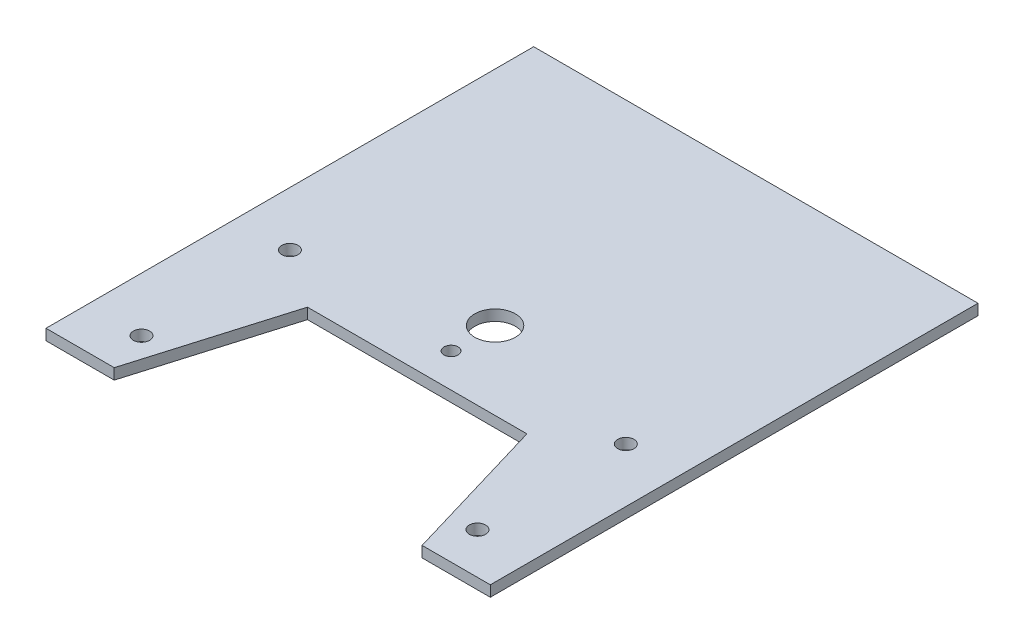
ISO-10303-21;
HEADER;
FILE_DESCRIPTION(('STEP AP214'),'2;1');
FILE_NAME('part.step','',(''),(''),'','','');
FILE_SCHEMA(('AUTOMOTIVE_DESIGN { 1 0 10303 214 1 1 1 1 }'));
ENDSEC;
DATA;
#1=APPLICATION_CONTEXT('core data for automotive mechanical design processes');
#2=APPLICATION_PROTOCOL_DEFINITION('international standard','automotive_design',2000,#1);
#3=PRODUCT_CONTEXT('',#1,'mechanical');
#4=PRODUCT('Part','Part','',(#3));
#5=PRODUCT_RELATED_PRODUCT_CATEGORY('part','',(#4));
#6=PRODUCT_DEFINITION_FORMATION('','',#4);
#7=PRODUCT_DEFINITION_CONTEXT('part definition',#1,'design');
#8=PRODUCT_DEFINITION('design','',#6,#7);
#9=PRODUCT_DEFINITION_SHAPE('','',#8);
#10=(LENGTH_UNIT() NAMED_UNIT(*) SI_UNIT(.MILLI.,.METRE.));
#11=(NAMED_UNIT(*) PLANE_ANGLE_UNIT() SI_UNIT($,.RADIAN.));
#12=(NAMED_UNIT(*) SI_UNIT($,.STERADIAN.) SOLID_ANGLE_UNIT());
#13=UNCERTAINTY_MEASURE_WITH_UNIT(LENGTH_MEASURE(1.E-05),#10,'distance_accuracy_value','');
#14=(GEOMETRIC_REPRESENTATION_CONTEXT(3) GLOBAL_UNCERTAINTY_ASSIGNED_CONTEXT((#13)) GLOBAL_UNIT_ASSIGNED_CONTEXT((#10,
#11,#12)) REPRESENTATION_CONTEXT('',''));
#15=CARTESIAN_POINT('',(0.,0.,0.));
#16=DIRECTION('',(0.,0.,1.));
#17=DIRECTION('',(1.,0.,0.));
#18=AXIS2_PLACEMENT_3D('',#15,#16,#17);
#19=CARTESIAN_POINT('',(0.,4.,0.));
#20=DIRECTION('',(0.,1.,0.));
#21=DIRECTION('',(0.,0.,1.));
#22=AXIS2_PLACEMENT_3D('',#19,#20,#21);
#23=PLANE('',#22);
#24=CARTESIAN_POINT('',(-62.,4.,19.99));
#25=DIRECTION('',(0.,-1.,0.));
#26=DIRECTION('',(0.,0.,-1.));
#27=AXIS2_PLACEMENT_3D('',#24,#25,#26);
#28=CIRCLE('',#27,3.);
#29=CARTESIAN_POINT('',(-62.,4.,16.99));
#30=VERTEX_POINT('',#29);
#31=EDGE_CURVE('E156',#30,#30,#28,.T.);
#32=ORIENTED_EDGE('',*,*,#31,.T.);
#33=EDGE_LOOP('',(#32));
#34=FACE_BOUND('',#33,.T.);
#35=CARTESIAN_POINT('',(-62.,4.,74.7499999999999));
#36=DIRECTION('',(0.,-1.,0.));
#37=DIRECTION('',(0.,0.,-1.));
#38=AXIS2_PLACEMENT_3D('',#35,#36,#37);
#39=CIRCLE('',#38,3.);
#40=CARTESIAN_POINT('',(-62.,4.,71.7499999999999));
#41=VERTEX_POINT('',#40);
#42=EDGE_CURVE('E148',#41,#41,#39,.T.);
#43=ORIENTED_EDGE('',*,*,#42,.T.);
#44=EDGE_LOOP('',(#43));
#45=FACE_BOUND('',#44,.T.);
#46=DIRECTION('',(-1.,0.,0.));
#47=VECTOR('',#46,1.);
#48=CARTESIAN_POINT('',(0.,4.,35.));
#49=LINE('',#48,#47);
#50=CARTESIAN_POINT('',(40.5,4.,35.));
#51=VERTEX_POINT('',#50);
#52=CARTESIAN_POINT('',(-40.5,4.,35.));
#53=VERTEX_POINT('',#52);
#54=EDGE_CURVE('E140',#51,#53,#49,.T.);
#55=ORIENTED_EDGE('',*,*,#54,.F.);
#56=DIRECTION('',(-0.284414731086838,0.,-0.958701340742153));
#57=VECTOR('',#56,1.);
#58=CARTESIAN_POINT('',(27.6804771193105,4.,-8.21187487872877));
#59=LINE('',#58,#57);
#60=CARTESIAN_POINT('',(56.8166666666666,4.,89.9999999999999));
#61=VERTEX_POINT('',#60);
#62=EDGE_CURVE('E134',#61,#51,#59,.T.);
#63=ORIENTED_EDGE('',*,*,#62,.F.);
#64=DIRECTION('',(1.,0.,0.));
#65=VECTOR('',#64,1.);
#66=CARTESIAN_POINT('',(0.,4.,89.9999999999999));
#67=LINE('',#66,#65);
#68=CARTESIAN_POINT('',(82.,4.,89.9999999999999));
#69=VERTEX_POINT('',#68);
#70=EDGE_CURVE('E129',#61,#69,#67,.T.);
#71=ORIENTED_EDGE('',*,*,#70,.T.);
#72=DIRECTION('',(0.,0.,1.));
#73=VECTOR('',#72,1.);
#74=CARTESIAN_POINT('',(82.,4.,0.));
#75=LINE('',#74,#73);
#76=CARTESIAN_POINT('',(82.,4.,-90.0000000000001));
#77=VERTEX_POINT('',#76);
#78=EDGE_CURVE('E133',#77,#69,#75,.T.);
#79=ORIENTED_EDGE('',*,*,#78,.F.);
#80=DIRECTION('',(1.,0.,0.));
#81=VECTOR('',#80,1.);
#82=CARTESIAN_POINT('',(0.,4.,-90.0000000000001));
#83=LINE('',#82,#81);
#84=CARTESIAN_POINT('',(-82.,4.,-90.0000000000001));
#85=VERTEX_POINT('',#84);
#86=EDGE_CURVE('E114',#85,#77,#83,.T.);
#87=ORIENTED_EDGE('',*,*,#86,.F.);
#88=DIRECTION('',(0.,0.,1.));
#89=VECTOR('',#88,1.);
#90=CARTESIAN_POINT('',(-82.,4.,0.));
#91=LINE('',#90,#89);
#92=CARTESIAN_POINT('',(-82.,4.,89.9999999999999));
#93=VERTEX_POINT('',#92);
#94=EDGE_CURVE('E106',#85,#93,#91,.T.);
#95=ORIENTED_EDGE('',*,*,#94,.T.);
#96=CARTESIAN_POINT('',(-56.8166666666667,4.,89.9999999999999));
#97=VERTEX_POINT('',#96);
#98=EDGE_CURVE('E111',#93,#97,#67,.T.);
#99=ORIENTED_EDGE('',*,*,#98,.T.);
#100=DIRECTION('',(-0.284414731086839,0.,0.958701340742153));
#101=VECTOR('',#100,1.);
#102=CARTESIAN_POINT('',(-27.6804771193105,4.,-8.21187487872878));
#103=LINE('',#102,#101);
#104=EDGE_CURVE('E127',#53,#97,#103,.T.);
#105=ORIENTED_EDGE('',*,*,#104,.F.);
#106=EDGE_LOOP('',(#55,#63,#71,#79,#87,#95,#99,#105));
#107=FACE_BOUND('',#106,.T.);
#108=CARTESIAN_POINT('',(0.,4.,22.5));
#109=DIRECTION('',(0.,1.,0.));
#110=DIRECTION('',(0.,0.,1.));
#111=AXIS2_PLACEMENT_3D('',#108,#109,#110);
#112=CIRCLE('',#111,2.6);
#113=CARTESIAN_POINT('',(0.,4.,25.1));
#114=VERTEX_POINT('',#113);
#115=EDGE_CURVE('E172',#114,#114,#112,.T.);
#116=ORIENTED_EDGE('',*,*,#115,.F.);
#117=EDGE_LOOP('',(#116));
#118=FACE_BOUND('',#117,.T.);
#119=CARTESIAN_POINT('',(62.,4.,74.7499999999999));
#120=DIRECTION('',(0.,1.,0.));
#121=DIRECTION('',(0.,0.,1.));
#122=AXIS2_PLACEMENT_3D('',#119,#120,#121);
#123=CIRCLE('',#122,3.00000000000001);
#124=CARTESIAN_POINT('',(62.,4.,77.7499999999999));
#125=VERTEX_POINT('',#124);
#126=EDGE_CURVE('E153',#125,#125,#123,.T.);
#127=ORIENTED_EDGE('',*,*,#126,.F.);
#128=EDGE_LOOP('',(#127));
#129=FACE_BOUND('',#128,.T.);
#130=CARTESIAN_POINT('',(62.,4.,19.9899999999999));
#131=DIRECTION('',(0.,1.,0.));
#132=DIRECTION('',(0.,0.,1.));
#133=AXIS2_PLACEMENT_3D('',#130,#131,#132);
#134=CIRCLE('',#133,3.00000000000001);
#135=CARTESIAN_POINT('',(62.,4.,22.99));
#136=VERTEX_POINT('',#135);
#137=EDGE_CURVE('E160',#136,#136,#134,.T.);
#138=ORIENTED_EDGE('',*,*,#137,.F.);
#139=EDGE_LOOP('',(#138));
#140=FACE_BOUND('',#139,.T.);
#141=CARTESIAN_POINT('',(0.,4.,6.24999999999995));
#142=DIRECTION('',(0.,1.,0.));
#143=DIRECTION('',(0.,0.,1.));
#144=AXIS2_PLACEMENT_3D('',#141,#142,#143);
#145=CIRCLE('',#144,7.5);
#146=CARTESIAN_POINT('',(0.,4.,13.75));
#147=VERTEX_POINT('',#146);
#148=EDGE_CURVE('E165',#147,#147,#145,.T.);
#149=ORIENTED_EDGE('',*,*,#148,.F.);
#150=EDGE_LOOP('',(#149));
#151=FACE_BOUND('',#150,.T.);
#152=ADVANCED_FACE('F38',(#34,#45,#107,#118,#129,#140,#151),#23,.T.);
#153=CARTESIAN_POINT('',(0.,0.,0.));
#154=DIRECTION('',(0.,1.,0.));
#155=DIRECTION('',(0.,0.,1.));
#156=AXIS2_PLACEMENT_3D('',#153,#154,#155);
#157=PLANE('',#156);
#158=CARTESIAN_POINT('',(62.,0.,19.9899999999999));
#159=DIRECTION('',(0.,1.,0.));
#160=DIRECTION('',(0.,0.,1.));
#161=AXIS2_PLACEMENT_3D('',#158,#159,#160);
#162=CIRCLE('',#161,3.00000000000001);
#163=CARTESIAN_POINT('',(62.,0.,22.99));
#164=VERTEX_POINT('',#163);
#165=EDGE_CURVE('E168',#164,#164,#162,.F.);
#166=ORIENTED_EDGE('',*,*,#165,.F.);
#167=EDGE_LOOP('',(#166));
#168=FACE_BOUND('',#167,.T.);
#169=CARTESIAN_POINT('',(0.,0.,22.5));
#170=DIRECTION('',(0.,1.,0.));
#171=DIRECTION('',(0.,0.,1.));
#172=AXIS2_PLACEMENT_3D('',#169,#170,#171);
#173=CIRCLE('',#172,2.6);
#174=CARTESIAN_POINT('',(0.,0.,25.1));
#175=VERTEX_POINT('',#174);
#176=EDGE_CURVE('E179',#175,#175,#173,.F.);
#177=ORIENTED_EDGE('',*,*,#176,.F.);
#178=EDGE_LOOP('',(#177));
#179=FACE_BOUND('',#178,.T.);
#180=CARTESIAN_POINT('',(-62.,0.,74.7499999999999));
#181=DIRECTION('',(0.,1.,0.));
#182=DIRECTION('',(0.,0.,1.));
#183=AXIS2_PLACEMENT_3D('',#180,#181,#182);
#184=CIRCLE('',#183,3.);
#185=CARTESIAN_POINT('',(-62.,0.,77.7499999999999));
#186=VERTEX_POINT('',#185);
#187=EDGE_CURVE('E145',#186,#186,#184,.T.);
#188=ORIENTED_EDGE('',*,*,#187,.T.);
#189=EDGE_LOOP('',(#188));
#190=FACE_BOUND('',#189,.T.);
#191=DIRECTION('',(-1.,0.,0.));
#192=VECTOR('',#191,1.);
#193=CARTESIAN_POINT('',(0.,0.,35.));
#194=LINE('',#193,#192);
#195=CARTESIAN_POINT('',(40.5,0.,35.));
#196=VERTEX_POINT('',#195);
#197=CARTESIAN_POINT('',(-40.5,0.,35.));
#198=VERTEX_POINT('',#197);
#199=EDGE_CURVE('E152',#196,#198,#194,.T.);
#200=ORIENTED_EDGE('',*,*,#199,.T.);
#201=DIRECTION('',(-0.284414731086839,0.,0.958701340742153));
#202=VECTOR('',#201,1.);
#203=CARTESIAN_POINT('',(-27.6804771193105,0.,-8.21187487872878));
#204=LINE('',#203,#202);
#205=CARTESIAN_POINT('',(-56.8166666666667,0.,89.9999999999999));
#206=VERTEX_POINT('',#205);
#207=EDGE_CURVE('E142',#198,#206,#204,.T.);
#208=ORIENTED_EDGE('',*,*,#207,.T.);
#209=DIRECTION('',(1.,0.,0.));
#210=VECTOR('',#209,1.);
#211=CARTESIAN_POINT('',(0.,0.,89.9999999999999));
#212=LINE('',#211,#210);
#213=CARTESIAN_POINT('',(-82.,0.,89.9999999999999));
#214=VERTEX_POINT('',#213);
#215=EDGE_CURVE('E253',#214,#206,#212,.T.);
#216=ORIENTED_EDGE('',*,*,#215,.F.);
#217=DIRECTION('',(0.,0.,1.));
#218=VECTOR('',#217,1.);
#219=CARTESIAN_POINT('',(-82.,0.,0.));
#220=LINE('',#219,#218);
#221=CARTESIAN_POINT('',(-82.,0.,-90.0000000000001));
#222=VERTEX_POINT('',#221);
#223=EDGE_CURVE('E121',#222,#214,#220,.T.);
#224=ORIENTED_EDGE('',*,*,#223,.F.);
#225=DIRECTION('',(1.,0.,0.));
#226=VECTOR('',#225,1.);
#227=CARTESIAN_POINT('',(0.,0.,-90.0000000000001));
#228=LINE('',#227,#226);
#229=CARTESIAN_POINT('',(82.,0.,-90.0000000000001));
#230=VERTEX_POINT('',#229);
#231=EDGE_CURVE('E258',#222,#230,#228,.T.);
#232=ORIENTED_EDGE('',*,*,#231,.T.);
#233=DIRECTION('',(0.,0.,1.));
#234=VECTOR('',#233,1.);
#235=CARTESIAN_POINT('',(82.,0.,0.));
#236=LINE('',#235,#234);
#237=CARTESIAN_POINT('',(82.,0.,89.9999999999999));
#238=VERTEX_POINT('',#237);
#239=EDGE_CURVE('E251',#230,#238,#236,.T.);
#240=ORIENTED_EDGE('',*,*,#239,.T.);
#241=CARTESIAN_POINT('',(56.8166666666666,0.,89.9999999999999));
#242=VERTEX_POINT('',#241);
#243=EDGE_CURVE('E248',#242,#238,#212,.T.);
#244=ORIENTED_EDGE('',*,*,#243,.F.);
#245=DIRECTION('',(-0.284414731086838,0.,-0.958701340742153));
#246=VECTOR('',#245,1.);
#247=CARTESIAN_POINT('',(27.6804771193105,0.,-8.21187487872877));
#248=LINE('',#247,#246);
#249=EDGE_CURVE('E246',#242,#196,#248,.T.);
#250=ORIENTED_EDGE('',*,*,#249,.T.);
#251=EDGE_LOOP('',(#200,#208,#216,#224,#232,#240,#244,#250));
#252=FACE_BOUND('',#251,.T.);
#253=CARTESIAN_POINT('',(-62.,0.,19.99));
#254=DIRECTION('',(0.,1.,0.));
#255=DIRECTION('',(0.,0.,1.));
#256=AXIS2_PLACEMENT_3D('',#253,#254,#255);
#257=CIRCLE('',#256,3.);
#258=CARTESIAN_POINT('',(-62.,0.,22.99));
#259=VERTEX_POINT('',#258);
#260=EDGE_CURVE('E149',#259,#259,#257,.T.);
#261=ORIENTED_EDGE('',*,*,#260,.T.);
#262=EDGE_LOOP('',(#261));
#263=FACE_BOUND('',#262,.T.);
#264=CARTESIAN_POINT('',(62.,0.,74.7499999999999));
#265=DIRECTION('',(0.,1.,0.));
#266=DIRECTION('',(0.,0.,1.));
#267=AXIS2_PLACEMENT_3D('',#264,#265,#266);
#268=CIRCLE('',#267,3.00000000000001);
#269=CARTESIAN_POINT('',(62.,0.,77.7499999999999));
#270=VERTEX_POINT('',#269);
#271=EDGE_CURVE('E157',#270,#270,#268,.F.);
#272=ORIENTED_EDGE('',*,*,#271,.F.);
#273=EDGE_LOOP('',(#272));
#274=FACE_BOUND('',#273,.T.);
#275=CARTESIAN_POINT('',(0.,0.,6.24999999999995));
#276=DIRECTION('',(0.,1.,0.));
#277=DIRECTION('',(0.,0.,1.));
#278=AXIS2_PLACEMENT_3D('',#275,#276,#277);
#279=CIRCLE('',#278,7.5);
#280=CARTESIAN_POINT('',(0.,0.,13.75));
#281=VERTEX_POINT('',#280);
#282=EDGE_CURVE('E169',#281,#281,#279,.F.);
#283=ORIENTED_EDGE('',*,*,#282,.F.);
#284=EDGE_LOOP('',(#283));
#285=FACE_BOUND('',#284,.T.);
#286=ADVANCED_FACE('F185',(#168,#179,#190,#252,#263,#274,#285),#157,.F.);
#287=CARTESIAN_POINT('',(0.,4.,35.));
#288=DIRECTION('',(0.,0.,1.));
#289=DIRECTION('',(1.,0.,0.));
#290=AXIS2_PLACEMENT_3D('',#287,#288,#289);
#291=PLANE('',#290);
#292=ORIENTED_EDGE('',*,*,#199,.F.);
#293=DIRECTION('',(0.,-1.,0.));
#294=VECTOR('',#293,1.);
#295=CARTESIAN_POINT('',(40.5,4.,35.));
#296=LINE('',#295,#294);
#297=EDGE_CURVE('E11',#51,#196,#296,.T.);
#298=ORIENTED_EDGE('',*,*,#297,.F.);
#299=ORIENTED_EDGE('',*,*,#54,.T.);
#300=DIRECTION('',(0.,-1.,0.));
#301=VECTOR('',#300,1.);
#302=CARTESIAN_POINT('',(-40.5,4.,35.));
#303=LINE('',#302,#301);
#304=EDGE_CURVE('E55',#53,#198,#303,.T.);
#305=ORIENTED_EDGE('',*,*,#304,.T.);
#306=EDGE_LOOP('',(#292,#298,#299,#305));
#307=FACE_BOUND('',#306,.T.);
#308=ADVANCED_FACE('F40',(#307),#291,.T.);
#309=CARTESIAN_POINT('',(27.6804771193105,4.,-8.21187487872877));
#310=DIRECTION('',(-0.958701340742153,0.,0.284414731086838));
#311=DIRECTION('',(0.284414731086838,0.,0.958701340742153));
#312=AXIS2_PLACEMENT_3D('',#309,#310,#311);
#313=PLANE('',#312);
#314=ORIENTED_EDGE('',*,*,#249,.F.);
#315=DIRECTION('',(0.,-1.,0.));
#316=VECTOR('',#315,1.);
#317=CARTESIAN_POINT('',(56.8166666666666,4.,89.9999999999999));
#318=LINE('',#317,#316);
#319=EDGE_CURVE('E47',#61,#242,#318,.T.);
#320=ORIENTED_EDGE('',*,*,#319,.F.);
#321=ORIENTED_EDGE('',*,*,#62,.T.);
#322=ORIENTED_EDGE('',*,*,#297,.T.);
#323=EDGE_LOOP('',(#314,#320,#321,#322));
#324=FACE_BOUND('',#323,.T.);
#325=ADVANCED_FACE('F238',(#324),#313,.T.);
#326=CARTESIAN_POINT('',(0.,4.,89.9999999999999));
#327=DIRECTION('',(0.,0.,-1.));
#328=DIRECTION('',(-1.,0.,0.));
#329=AXIS2_PLACEMENT_3D('',#326,#327,#328);
#330=PLANE('',#329);
#331=ORIENTED_EDGE('',*,*,#243,.T.);
#332=DIRECTION('',(0.,-1.,0.));
#333=VECTOR('',#332,1.);
#334=CARTESIAN_POINT('',(82.,4.,89.9999999999999));
#335=LINE('',#334,#333);
#336=EDGE_CURVE('E268',#69,#238,#335,.T.);
#337=ORIENTED_EDGE('',*,*,#336,.F.);
#338=ORIENTED_EDGE('',*,*,#70,.F.);
#339=ORIENTED_EDGE('',*,*,#319,.T.);
#340=EDGE_LOOP('',(#331,#337,#338,#339));
#341=FACE_BOUND('',#340,.T.);
#342=ADVANCED_FACE('F228',(#341),#330,.F.);
#343=CARTESIAN_POINT('',(82.,4.,0.));
#344=DIRECTION('',(1.,0.,0.));
#345=DIRECTION('',(0.,0.,-1.));
#346=AXIS2_PLACEMENT_3D('',#343,#344,#345);
#347=PLANE('',#346);
#348=ORIENTED_EDGE('',*,*,#239,.F.);
#349=DIRECTION('',(0.,-1.,0.));
#350=VECTOR('',#349,1.);
#351=CARTESIAN_POINT('',(82.,4.,-90.0000000000001));
#352=LINE('',#351,#350);
#353=EDGE_CURVE('E266',#77,#230,#352,.T.);
#354=ORIENTED_EDGE('',*,*,#353,.F.);
#355=ORIENTED_EDGE('',*,*,#78,.T.);
#356=ORIENTED_EDGE('',*,*,#336,.T.);
#357=EDGE_LOOP('',(#348,#354,#355,#356));
#358=FACE_BOUND('',#357,.T.);
#359=ADVANCED_FACE('F234',(#358),#347,.T.);
#360=CARTESIAN_POINT('',(0.,4.,-90.0000000000001));
#361=DIRECTION('',(0.,0.,-1.));
#362=DIRECTION('',(-1.,0.,0.));
#363=AXIS2_PLACEMENT_3D('',#360,#361,#362);
#364=PLANE('',#363);
#365=ORIENTED_EDGE('',*,*,#231,.F.);
#366=DIRECTION('',(0.,-1.,0.));
#367=VECTOR('',#366,1.);
#368=CARTESIAN_POINT('',(-82.,4.,-90.0000000000001));
#369=LINE('',#368,#367);
#370=EDGE_CURVE('E124',#85,#222,#369,.T.);
#371=ORIENTED_EDGE('',*,*,#370,.F.);
#372=ORIENTED_EDGE('',*,*,#86,.T.);
#373=ORIENTED_EDGE('',*,*,#353,.T.);
#374=EDGE_LOOP('',(#365,#371,#372,#373));
#375=FACE_BOUND('',#374,.T.);
#376=ADVANCED_FACE('F231',(#375),#364,.T.);
#377=CARTESIAN_POINT('',(-82.,4.,0.));
#378=DIRECTION('',(1.,0.,0.));
#379=DIRECTION('',(0.,0.,-1.));
#380=AXIS2_PLACEMENT_3D('',#377,#378,#379);
#381=PLANE('',#380);
#382=ORIENTED_EDGE('',*,*,#223,.T.);
#383=DIRECTION('',(0.,-1.,0.));
#384=VECTOR('',#383,1.);
#385=CARTESIAN_POINT('',(-82.,4.,89.9999999999999));
#386=LINE('',#385,#384);
#387=EDGE_CURVE('E118',#93,#214,#386,.T.);
#388=ORIENTED_EDGE('',*,*,#387,.F.);
#389=ORIENTED_EDGE('',*,*,#94,.F.);
#390=ORIENTED_EDGE('',*,*,#370,.T.);
#391=EDGE_LOOP('',(#382,#388,#389,#390));
#392=FACE_BOUND('',#391,.T.);
#393=ADVANCED_FACE('F119',(#392),#381,.F.);
#394=ORIENTED_EDGE('',*,*,#215,.T.);
#395=DIRECTION('',(0.,-1.,0.));
#396=VECTOR('',#395,1.);
#397=CARTESIAN_POINT('',(-56.8166666666667,4.,89.9999999999999));
#398=LINE('',#397,#396);
#399=EDGE_CURVE('E81',#97,#206,#398,.T.);
#400=ORIENTED_EDGE('',*,*,#399,.F.);
#401=ORIENTED_EDGE('',*,*,#98,.F.);
#402=ORIENTED_EDGE('',*,*,#387,.T.);
#403=EDGE_LOOP('',(#394,#400,#401,#402));
#404=FACE_BOUND('',#403,.T.);
#405=ADVANCED_FACE('F126',(#404),#330,.F.);
#406=CARTESIAN_POINT('',(-27.6804771193105,4.,-8.21187487872878));
#407=DIRECTION('',(0.958701340742153,0.,0.284414731086839));
#408=DIRECTION('',(0.284414731086839,0.,-0.958701340742153));
#409=AXIS2_PLACEMENT_3D('',#406,#407,#408);
#410=PLANE('',#409);
#411=ORIENTED_EDGE('',*,*,#207,.F.);
#412=ORIENTED_EDGE('',*,*,#304,.F.);
#413=ORIENTED_EDGE('',*,*,#104,.T.);
#414=ORIENTED_EDGE('',*,*,#399,.T.);
#415=EDGE_LOOP('',(#411,#412,#413,#414));
#416=FACE_BOUND('',#415,.T.);
#417=ADVANCED_FACE('F223',(#416),#410,.T.);
#418=CARTESIAN_POINT('',(-62.,-0.00100000000000013,74.7499999999999));
#419=DIRECTION('',(0.,1.,0.));
#420=DIRECTION('',(0.,0.,1.));
#421=AXIS2_PLACEMENT_3D('',#418,#419,#420);
#422=CYLINDRICAL_SURFACE('',#421,3.);
#423=ORIENTED_EDGE('',*,*,#42,.F.);
#424=EDGE_LOOP('',(#423));
#425=FACE_BOUND('',#424,.T.);
#426=ORIENTED_EDGE('',*,*,#187,.F.);
#427=EDGE_LOOP('',(#426));
#428=FACE_BOUND('',#427,.T.);
#429=ADVANCED_FACE('F220',(#425,#428),#422,.F.);
#430=CARTESIAN_POINT('',(0.,-0.00100000000000013,22.5));
#431=DIRECTION('',(0.,1.,0.));
#432=DIRECTION('',(0.,0.,1.));
#433=AXIS2_PLACEMENT_3D('',#430,#431,#432);
#434=CYLINDRICAL_SURFACE('',#433,2.6);
#435=ORIENTED_EDGE('',*,*,#115,.T.);
#436=EDGE_LOOP('',(#435));
#437=FACE_BOUND('',#436,.T.);
#438=ORIENTED_EDGE('',*,*,#176,.T.);
#439=EDGE_LOOP('',(#438));
#440=FACE_BOUND('',#439,.T.);
#441=ADVANCED_FACE('F183',(#437,#440),#434,.F.);
#442=CARTESIAN_POINT('',(-62.,-0.00100000000000013,19.99));
#443=DIRECTION('',(0.,1.,0.));
#444=DIRECTION('',(0.,0.,1.));
#445=AXIS2_PLACEMENT_3D('',#442,#443,#444);
#446=CYLINDRICAL_SURFACE('',#445,3.);
#447=ORIENTED_EDGE('',*,*,#31,.F.);
#448=EDGE_LOOP('',(#447));
#449=FACE_BOUND('',#448,.T.);
#450=ORIENTED_EDGE('',*,*,#260,.F.);
#451=EDGE_LOOP('',(#450));
#452=FACE_BOUND('',#451,.T.);
#453=ADVANCED_FACE('F301',(#449,#452),#446,.F.);
#454=CARTESIAN_POINT('',(62.,-0.00100000000000013,74.7499999999999));
#455=DIRECTION('',(0.,1.,0.));
#456=DIRECTION('',(0.,0.,1.));
#457=AXIS2_PLACEMENT_3D('',#454,#455,#456);
#458=CYLINDRICAL_SURFACE('',#457,3.00000000000001);
#459=ORIENTED_EDGE('',*,*,#126,.T.);
#460=EDGE_LOOP('',(#459));
#461=FACE_BOUND('',#460,.T.);
#462=ORIENTED_EDGE('',*,*,#271,.T.);
#463=EDGE_LOOP('',(#462));
#464=FACE_BOUND('',#463,.T.);
#465=ADVANCED_FACE('F209',(#461,#464),#458,.F.);
#466=CARTESIAN_POINT('',(62.,-0.00100000000000013,19.9899999999999));
#467=DIRECTION('',(0.,1.,0.));
#468=DIRECTION('',(0.,0.,1.));
#469=AXIS2_PLACEMENT_3D('',#466,#467,#468);
#470=CYLINDRICAL_SURFACE('',#469,3.00000000000001);
#471=ORIENTED_EDGE('',*,*,#137,.T.);
#472=EDGE_LOOP('',(#471));
#473=FACE_BOUND('',#472,.T.);
#474=ORIENTED_EDGE('',*,*,#165,.T.);
#475=EDGE_LOOP('',(#474));
#476=FACE_BOUND('',#475,.T.);
#477=ADVANCED_FACE('F203',(#473,#476),#470,.F.);
#478=CARTESIAN_POINT('',(0.,-0.00100000000000013,6.24999999999995));
#479=DIRECTION('',(0.,1.,0.));
#480=DIRECTION('',(0.,0.,1.));
#481=AXIS2_PLACEMENT_3D('',#478,#479,#480);
#482=CYLINDRICAL_SURFACE('',#481,7.5);
#483=ORIENTED_EDGE('',*,*,#148,.T.);
#484=EDGE_LOOP('',(#483));
#485=FACE_BOUND('',#484,.T.);
#486=ORIENTED_EDGE('',*,*,#282,.T.);
#487=EDGE_LOOP('',(#486));
#488=FACE_BOUND('',#487,.T.);
#489=ADVANCED_FACE('F201',(#485,#488),#482,.F.);
#490=CLOSED_SHELL('',(#152,#286,#308,#325,#342,#359,#376,#393,#405,#417,#429,#441,#453,#465,
#477,#489));
#491=MANIFOLD_SOLID_BREP('B2',#490);
#492=ADVANCED_BREP_SHAPE_REPRESENTATION('',(#18,#491),#14);
#493=SHAPE_DEFINITION_REPRESENTATION(#9,#492);
ENDSEC;
END-ISO-10303-21;
